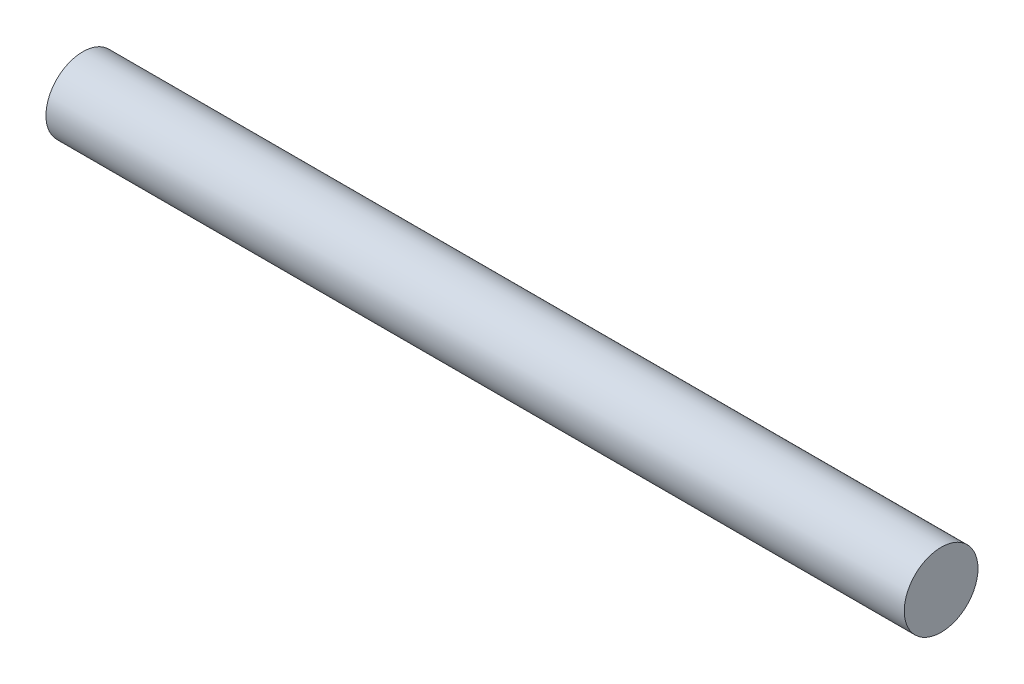
ISO-10303-21;
HEADER;
FILE_DESCRIPTION(('STEP AP214'),'2;1');
FILE_NAME('part.step','',(''),(''),'','','');
FILE_SCHEMA(('AUTOMOTIVE_DESIGN { 1 0 10303 214 1 1 1 1 }'));
ENDSEC;
DATA;
#1=APPLICATION_CONTEXT('core data for automotive mechanical design processes');
#2=APPLICATION_PROTOCOL_DEFINITION('international standard','automotive_design',2000,#1);
#3=PRODUCT_CONTEXT('',#1,'mechanical');
#4=PRODUCT('Part','Part','',(#3));
#5=PRODUCT_RELATED_PRODUCT_CATEGORY('part','',(#4));
#6=PRODUCT_DEFINITION_FORMATION('','',#4);
#7=PRODUCT_DEFINITION_CONTEXT('part definition',#1,'design');
#8=PRODUCT_DEFINITION('design','',#6,#7);
#9=PRODUCT_DEFINITION_SHAPE('','',#8);
#10=(LENGTH_UNIT() NAMED_UNIT(*) SI_UNIT(.MILLI.,.METRE.));
#11=(NAMED_UNIT(*) PLANE_ANGLE_UNIT() SI_UNIT($,.RADIAN.));
#12=(NAMED_UNIT(*) SI_UNIT($,.STERADIAN.) SOLID_ANGLE_UNIT());
#13=UNCERTAINTY_MEASURE_WITH_UNIT(LENGTH_MEASURE(1.E-05),#10,'distance_accuracy_value','');
#14=(GEOMETRIC_REPRESENTATION_CONTEXT(3) GLOBAL_UNCERTAINTY_ASSIGNED_CONTEXT((#13)) GLOBAL_UNIT_ASSIGNED_CONTEXT((#10,
#11,#12)) REPRESENTATION_CONTEXT('',''));
#15=CARTESIAN_POINT('',(0.,0.,0.));
#16=DIRECTION('',(0.,0.,1.));
#17=DIRECTION('',(1.,0.,0.));
#18=AXIS2_PLACEMENT_3D('',#15,#16,#17);
#19=CARTESIAN_POINT('',(32.,0.,0.));
#20=DIRECTION('',(-1.,0.,0.));
#21=DIRECTION('',(0.,0.,1.));
#22=AXIS2_PLACEMENT_3D('',#19,#20,#21);
#23=CYLINDRICAL_SURFACE('',#22,2.75);
#24=CARTESIAN_POINT('',(32.,0.,0.));
#25=DIRECTION('',(1.,0.,0.));
#26=DIRECTION('',(0.,0.,-1.));
#27=AXIS2_PLACEMENT_3D('',#24,#25,#26);
#28=CIRCLE('',#27,2.75);
#29=CARTESIAN_POINT('',(32.,0.,-2.75));
#30=VERTEX_POINT('',#29);
#31=EDGE_CURVE('E10',#30,#30,#28,.T.);
#32=ORIENTED_EDGE('',*,*,#31,.F.);
#33=EDGE_LOOP('',(#32));
#34=FACE_BOUND('',#33,.T.);
#35=CARTESIAN_POINT('',(-32.,0.,0.));
#36=DIRECTION('',(1.,0.,0.));
#37=DIRECTION('',(0.,0.,-1.));
#38=AXIS2_PLACEMENT_3D('',#35,#36,#37);
#39=CIRCLE('',#38,2.75);
#40=CARTESIAN_POINT('',(-32.,0.,-2.75));
#41=VERTEX_POINT('',#40);
#42=EDGE_CURVE('E33',#41,#41,#39,.T.);
#43=ORIENTED_EDGE('',*,*,#42,.T.);
#44=EDGE_LOOP('',(#43));
#45=FACE_BOUND('',#44,.T.);
#46=ADVANCED_FACE('F30',(#34,#45),#23,.T.);
#47=CARTESIAN_POINT('',(32.,0.,0.));
#48=DIRECTION('',(1.,0.,0.));
#49=DIRECTION('',(0.,0.,-1.));
#50=AXIS2_PLACEMENT_3D('',#47,#48,#49);
#51=PLANE('',#50);
#52=ORIENTED_EDGE('',*,*,#31,.T.);
#53=EDGE_LOOP('',(#52));
#54=FACE_BOUND('',#53,.T.);
#55=ADVANCED_FACE('F45',(#54),#51,.T.);
#56=CARTESIAN_POINT('',(-32.,0.,0.));
#57=DIRECTION('',(1.,0.,0.));
#58=DIRECTION('',(0.,0.,-1.));
#59=AXIS2_PLACEMENT_3D('',#56,#57,#58);
#60=PLANE('',#59);
#61=ORIENTED_EDGE('',*,*,#42,.F.);
#62=EDGE_LOOP('',(#61));
#63=FACE_BOUND('',#62,.T.);
#64=ADVANCED_FACE('F43',(#63),#60,.F.);
#65=CLOSED_SHELL('',(#46,#55,#64));
#66=MANIFOLD_SOLID_BREP('B2',#65);
#67=ADVANCED_BREP_SHAPE_REPRESENTATION('',(#18,#66),#14);
#68=SHAPE_DEFINITION_REPRESENTATION(#9,#67);
ENDSEC;
END-ISO-10303-21;
